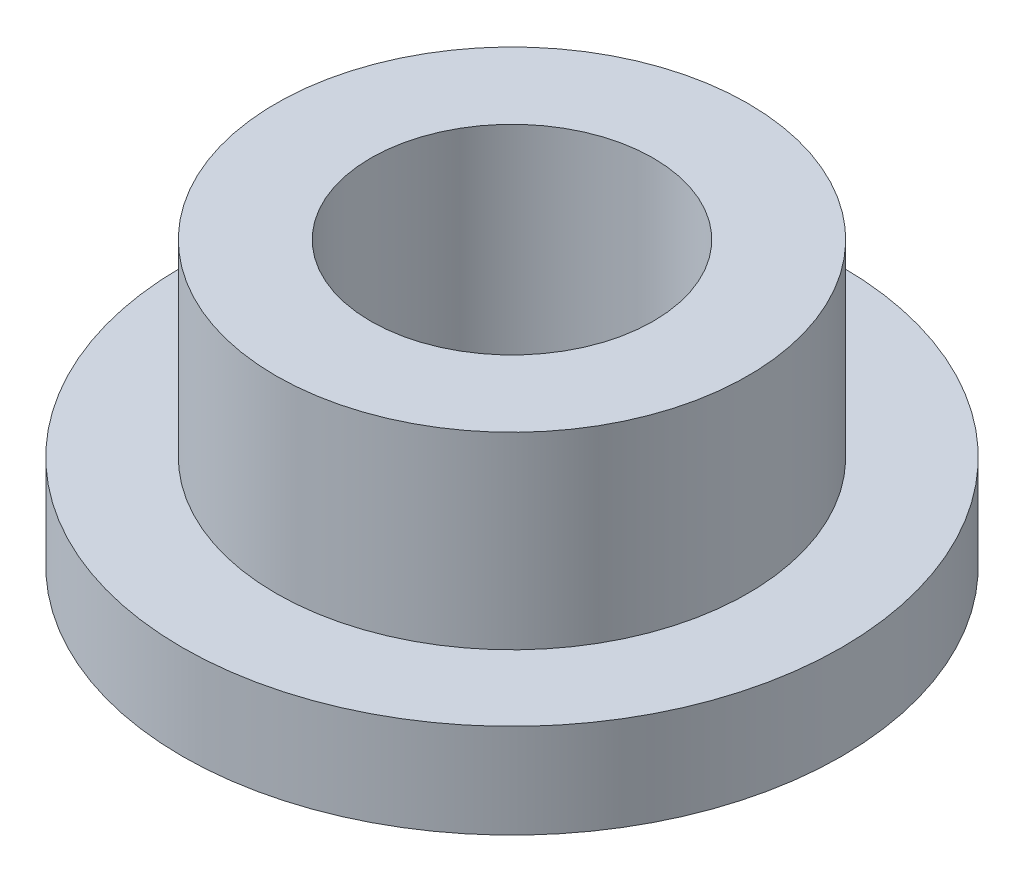
ISO-10303-21;
HEADER;
FILE_DESCRIPTION(('STEP AP214'),'2;1');
FILE_NAME('part.step','',(''),(''),'','','');
FILE_SCHEMA(('AUTOMOTIVE_DESIGN { 1 0 10303 214 1 1 1 1 }'));
ENDSEC;
DATA;
#1=APPLICATION_CONTEXT('core data for automotive mechanical design processes');
#2=APPLICATION_PROTOCOL_DEFINITION('international standard','automotive_design',2000,#1);
#3=PRODUCT_CONTEXT('',#1,'mechanical');
#4=PRODUCT('Part','Part','',(#3));
#5=PRODUCT_RELATED_PRODUCT_CATEGORY('part','',(#4));
#6=PRODUCT_DEFINITION_FORMATION('','',#4);
#7=PRODUCT_DEFINITION_CONTEXT('part definition',#1,'design');
#8=PRODUCT_DEFINITION('design','',#6,#7);
#9=PRODUCT_DEFINITION_SHAPE('','',#8);
#10=(LENGTH_UNIT() NAMED_UNIT(*) SI_UNIT(.MILLI.,.METRE.));
#11=(NAMED_UNIT(*) PLANE_ANGLE_UNIT() SI_UNIT($,.RADIAN.));
#12=(NAMED_UNIT(*) SI_UNIT($,.STERADIAN.) SOLID_ANGLE_UNIT());
#13=UNCERTAINTY_MEASURE_WITH_UNIT(LENGTH_MEASURE(1.E-05),#10,'distance_accuracy_value','');
#14=(GEOMETRIC_REPRESENTATION_CONTEXT(3) GLOBAL_UNCERTAINTY_ASSIGNED_CONTEXT((#13)) GLOBAL_UNIT_ASSIGNED_CONTEXT((#10,
#11,#12)) REPRESENTATION_CONTEXT('',''));
#15=CARTESIAN_POINT('',(0.,0.,0.));
#16=DIRECTION('',(0.,0.,1.));
#17=DIRECTION('',(1.,0.,0.));
#18=AXIS2_PLACEMENT_3D('',#15,#16,#17);
#19=CARTESIAN_POINT('',(0.,6.,0.));
#20=DIRECTION('',(0.,1.,0.));
#21=DIRECTION('',(0.,0.,1.));
#22=AXIS2_PLACEMENT_3D('',#19,#20,#21);
#23=PLANE('',#22);
#24=CARTESIAN_POINT('',(0.,6.,0.));
#25=DIRECTION('',(0.,1.,0.));
#26=DIRECTION('',(0.,0.,1.));
#27=AXIS2_PLACEMENT_3D('',#24,#25,#26);
#28=CIRCLE('',#27,5.01);
#29=CARTESIAN_POINT('',(0.,6.,5.01));
#30=VERTEX_POINT('',#29);
#31=EDGE_CURVE('E10',#30,#30,#28,.T.);
#32=ORIENTED_EDGE('',*,*,#31,.T.);
#33=EDGE_LOOP('',(#32));
#34=FACE_BOUND('',#33,.T.);
#35=CARTESIAN_POINT('',(0.,6.,0.));
#36=DIRECTION('',(0.,1.,0.));
#37=DIRECTION('',(0.,0.,1.));
#38=AXIS2_PLACEMENT_3D('',#35,#36,#37);
#39=CIRCLE('',#38,3.);
#40=CARTESIAN_POINT('',(0.,6.,3.));
#41=VERTEX_POINT('',#40);
#42=EDGE_CURVE('E39',#41,#41,#39,.T.);
#43=ORIENTED_EDGE('',*,*,#42,.F.);
#44=EDGE_LOOP('',(#43));
#45=FACE_BOUND('',#44,.T.);
#46=ADVANCED_FACE('F32',(#34,#45),#23,.T.);
#47=CARTESIAN_POINT('',(0.,0.,0.));
#48=DIRECTION('',(0.,1.,0.));
#49=DIRECTION('',(0.,0.,1.));
#50=AXIS2_PLACEMENT_3D('',#47,#48,#49);
#51=PLANE('',#50);
#52=CARTESIAN_POINT('',(0.,0.,0.));
#53=DIRECTION('',(0.,1.,0.));
#54=DIRECTION('',(0.,0.,1.));
#55=AXIS2_PLACEMENT_3D('',#52,#53,#54);
#56=CIRCLE('',#55,3.);
#57=CARTESIAN_POINT('',(0.,0.,3.));
#58=VERTEX_POINT('',#57);
#59=EDGE_CURVE('E43',#58,#58,#56,.T.);
#60=ORIENTED_EDGE('',*,*,#59,.T.);
#61=EDGE_LOOP('',(#60));
#62=FACE_BOUND('',#61,.T.);
#63=CARTESIAN_POINT('',(0.,0.,0.));
#64=DIRECTION('',(0.,1.,0.));
#65=DIRECTION('',(0.,0.,1.));
#66=AXIS2_PLACEMENT_3D('',#63,#64,#65);
#67=CIRCLE('',#66,7.);
#68=CARTESIAN_POINT('',(0.,0.,7.));
#69=VERTEX_POINT('',#68);
#70=EDGE_CURVE('E50',#69,#69,#67,.T.);
#71=ORIENTED_EDGE('',*,*,#70,.F.);
#72=EDGE_LOOP('',(#71));
#73=FACE_BOUND('',#72,.T.);
#74=ADVANCED_FACE('F75',(#62,#73),#51,.F.);
#75=CARTESIAN_POINT('',(0.,6.,0.));
#76=DIRECTION('',(0.,-1.,0.));
#77=DIRECTION('',(0.,0.,-1.));
#78=AXIS2_PLACEMENT_3D('',#75,#76,#77);
#79=CYLINDRICAL_SURFACE('',#78,5.01);
#80=CARTESIAN_POINT('',(0.,2.,0.));
#81=DIRECTION('',(0.,1.,0.));
#82=DIRECTION('',(0.,0.,1.));
#83=AXIS2_PLACEMENT_3D('',#80,#81,#82);
#84=CIRCLE('',#83,5.01);
#85=CARTESIAN_POINT('',(0.,2.,5.01));
#86=VERTEX_POINT('',#85);
#87=EDGE_CURVE('E53',#86,#86,#84,.T.);
#88=ORIENTED_EDGE('',*,*,#87,.T.);
#89=EDGE_LOOP('',(#88));
#90=FACE_BOUND('',#89,.T.);
#91=ORIENTED_EDGE('',*,*,#31,.F.);
#92=EDGE_LOOP('',(#91));
#93=FACE_BOUND('',#92,.T.);
#94=ADVANCED_FACE('F34',(#90,#93),#79,.T.);
#95=CARTESIAN_POINT('',(0.,6.,0.));
#96=DIRECTION('',(0.,-1.,0.));
#97=DIRECTION('',(0.,0.,-1.));
#98=AXIS2_PLACEMENT_3D('',#95,#96,#97);
#99=CYLINDRICAL_SURFACE('',#98,3.);
#100=ORIENTED_EDGE('',*,*,#42,.T.);
#101=EDGE_LOOP('',(#100));
#102=FACE_BOUND('',#101,.T.);
#103=ORIENTED_EDGE('',*,*,#59,.F.);
#104=EDGE_LOOP('',(#103));
#105=FACE_BOUND('',#104,.T.);
#106=ADVANCED_FACE('F64',(#102,#105),#99,.F.);
#107=CARTESIAN_POINT('',(0.,2.,0.));
#108=DIRECTION('',(0.,1.,0.));
#109=DIRECTION('',(0.,0.,1.));
#110=AXIS2_PLACEMENT_3D('',#107,#108,#109);
#111=PLANE('',#110);
#112=CARTESIAN_POINT('',(0.,2.,0.));
#113=DIRECTION('',(0.,1.,0.));
#114=DIRECTION('',(0.,0.,1.));
#115=AXIS2_PLACEMENT_3D('',#112,#113,#114);
#116=CIRCLE('',#115,7.);
#117=CARTESIAN_POINT('',(0.,2.,7.));
#118=VERTEX_POINT('',#117);
#119=EDGE_CURVE('E48',#118,#118,#116,.T.);
#120=ORIENTED_EDGE('',*,*,#119,.T.);
#121=EDGE_LOOP('',(#120));
#122=FACE_BOUND('',#121,.T.);
#123=ORIENTED_EDGE('',*,*,#87,.F.);
#124=EDGE_LOOP('',(#123));
#125=FACE_BOUND('',#124,.T.);
#126=ADVANCED_FACE('F61',(#122,#125),#111,.T.);
#127=CARTESIAN_POINT('',(0.,2.,0.));
#128=DIRECTION('',(0.,-1.,0.));
#129=DIRECTION('',(0.,0.,-1.));
#130=AXIS2_PLACEMENT_3D('',#127,#128,#129);
#131=CYLINDRICAL_SURFACE('',#130,7.);
#132=ORIENTED_EDGE('',*,*,#119,.F.);
#133=EDGE_LOOP('',(#132));
#134=FACE_BOUND('',#133,.T.);
#135=ORIENTED_EDGE('',*,*,#70,.T.);
#136=EDGE_LOOP('',(#135));
#137=FACE_BOUND('',#136,.T.);
#138=ADVANCED_FACE('F63',(#134,#137),#131,.T.);
#139=CLOSED_SHELL('',(#46,#74,#94,#106,#126,#138));
#140=MANIFOLD_SOLID_BREP('B2',#139);
#141=ADVANCED_BREP_SHAPE_REPRESENTATION('',(#18,#140),#14);
#142=SHAPE_DEFINITION_REPRESENTATION(#9,#141);
ENDSEC;
END-ISO-10303-21;
